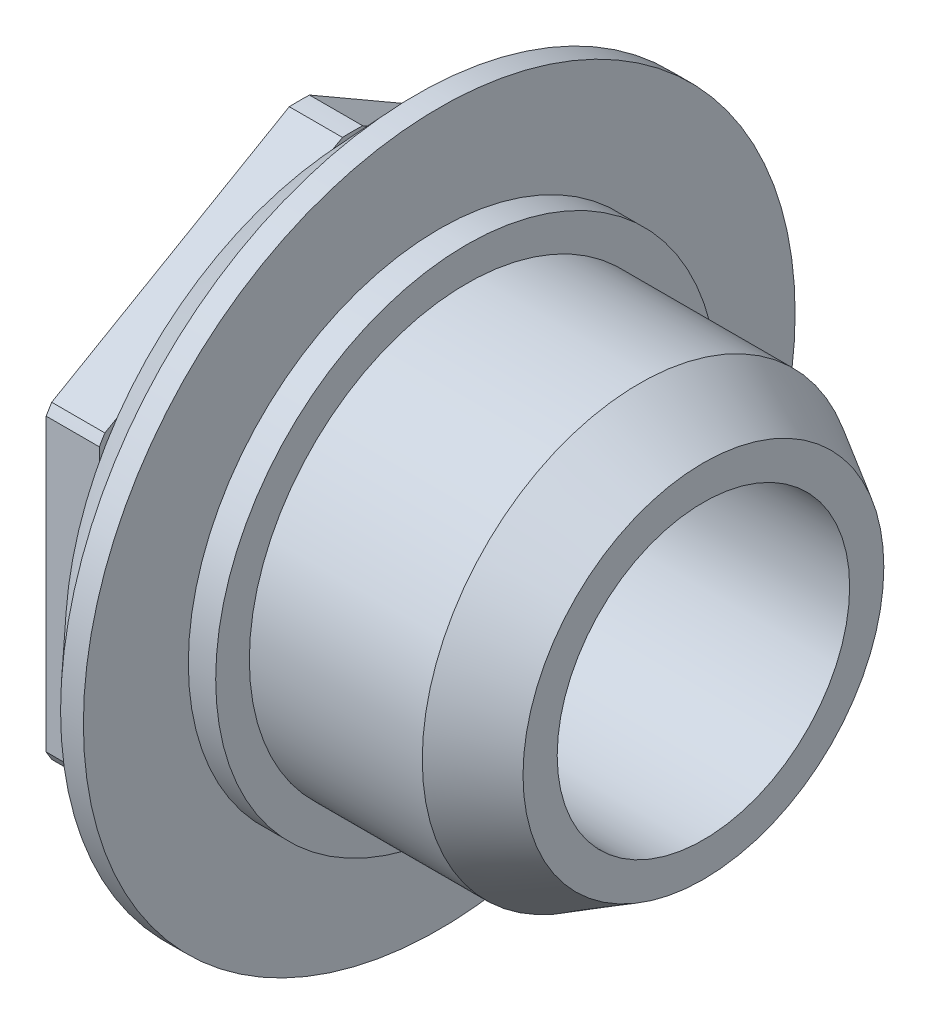
ISO-10303-21;
HEADER;
FILE_DESCRIPTION(('STEP AP214'),'2;1');
FILE_NAME('part.step','',(''),(''),'','','');
FILE_SCHEMA(('AUTOMOTIVE_DESIGN { 1 0 10303 214 1 1 1 1 }'));
ENDSEC;
DATA;
#1=APPLICATION_CONTEXT('core data for automotive mechanical design processes');
#2=APPLICATION_PROTOCOL_DEFINITION('international standard','automotive_design',2000,#1);
#3=PRODUCT_CONTEXT('',#1,'mechanical');
#4=PRODUCT('Part','Part','',(#3));
#5=PRODUCT_RELATED_PRODUCT_CATEGORY('part','',(#4));
#6=PRODUCT_DEFINITION_FORMATION('','',#4);
#7=PRODUCT_DEFINITION_CONTEXT('part definition',#1,'design');
#8=PRODUCT_DEFINITION('design','',#6,#7);
#9=PRODUCT_DEFINITION_SHAPE('','',#8);
#10=(LENGTH_UNIT() NAMED_UNIT(*) SI_UNIT(.MILLI.,.METRE.));
#11=(NAMED_UNIT(*) PLANE_ANGLE_UNIT() SI_UNIT($,.RADIAN.));
#12=(NAMED_UNIT(*) SI_UNIT($,.STERADIAN.) SOLID_ANGLE_UNIT());
#13=UNCERTAINTY_MEASURE_WITH_UNIT(LENGTH_MEASURE(1.E-05),#10,'distance_accuracy_value','');
#14=(GEOMETRIC_REPRESENTATION_CONTEXT(3) GLOBAL_UNCERTAINTY_ASSIGNED_CONTEXT((#13)) GLOBAL_UNIT_ASSIGNED_CONTEXT((#10,
#11,#12)) REPRESENTATION_CONTEXT('',''));
#15=CARTESIAN_POINT('',(0.,0.,0.));
#16=DIRECTION('',(0.,0.,1.));
#17=DIRECTION('',(1.,0.,0.));
#18=AXIS2_PLACEMENT_3D('',#15,#16,#17);
#19=CARTESIAN_POINT('',(-3.88678891678522,0.,0.));
#20=DIRECTION('',(0.818767862068712,0.394008378925014,0.417584225492671));
#21=DIRECTION('',(-0.454030191839795,0.88953011806887,0.0509190921590447));
#22=AXIS2_PLACEMENT_3D('',#19,#20,#21);
#23=SPHERICAL_SURFACE('',#22,15.8799999999365);
#24=CARTESIAN_POINT('',(-3.88678891678522,0.,0.));
#25=DIRECTION('',(-1.,0.,0.));
#26=DIRECTION('',(0.,-1.,0.));
#27=AXIS2_PLACEMENT_3D('',#24,#25,#26);
#28=SPHERICAL_SURFACE('',#27,15.8799999999365);
#29=CARTESIAN_POINT('',(-18.7653607567916,0.,0.));
#30=DIRECTION('',(-1.,0.,0.));
#31=DIRECTION('',(0.,-1.,0.));
#32=AXIS2_PLACEMENT_3D('',#29,#30,#31);
#33=CIRCLE('',#32,5.54999999997779);
#34=CARTESIAN_POINT('',(-18.7653607567916,0.,-5.54999999997779));
#35=VERTEX_POINT('',#34);
#36=CARTESIAN_POINT('',(-18.7653607567916,0.,5.54999999997779));
#37=VERTEX_POINT('',#36);
#38=EDGE_CURVE('E19',#35,#37,#33,.F.);
#39=ORIENTED_EDGE('',*,*,#38,.F.);
#40=CARTESIAN_POINT('',(-18.7653607567916,0.,0.));
#41=DIRECTION('',(-1.,0.,0.));
#42=DIRECTION('',(0.,-1.,0.));
#43=AXIS2_PLACEMENT_3D('',#40,#41,#42);
#44=CIRCLE('',#43,5.54999999997779);
#45=EDGE_CURVE('E109',#37,#35,#44,.F.);
#46=ORIENTED_EDGE('',*,*,#45,.F.);
#47=EDGE_LOOP('',(#39,#46));
#48=FACE_BOUND('',#47,.T.);
#49=CARTESIAN_POINT('',(-19.4399999999696,0.,0.));
#50=DIRECTION('',(-1.,0.,0.));
#51=DIRECTION('',(0.,0.,1.));
#52=AXIS2_PLACEMENT_3D('',#49,#50,#51);
#53=CIRCLE('',#52,3.20499999969);
#54=CARTESIAN_POINT('',(-19.4399999999696,0.,3.20499999969));
#55=VERTEX_POINT('',#54);
#56=EDGE_CURVE('E117',#55,#55,#53,.F.);
#57=ORIENTED_EDGE('',*,*,#56,.T.);
#58=EDGE_LOOP('',(#57));
#59=FACE_BOUND('',#58,.T.);
#60=ADVANCED_FACE('F16',(#48,#59),#28,.T.);
#61=CARTESIAN_POINT('',(-18.7653607567916,5.97499999997613,0.));
#62=DIRECTION('',(-1.,0.,0.));
#63=DIRECTION('',(0.,-1.,0.));
#64=AXIS2_PLACEMENT_3D('',#61,#62,#63);
#65=PLANE('',#64);
#66=DIRECTION('',(0.,-0.500000000005569,-0.866025403781224));
#67=VECTOR('',#66,1.);
#68=CARTESIAN_POINT('',(-18.7653607567916,6.39616528291186,-0.22151675635251));
#69=LINE('',#68,#67);
#70=CARTESIAN_POINT('',(-18.7653607567916,6.39616528291195,-0.221516756352401));
#71=VERTEX_POINT('',#70);
#72=CARTESIAN_POINT('',(-18.7653607567916,3.38992177975124,-5.42848324367323));
#73=VERTEX_POINT('',#72);
#74=EDGE_CURVE('E151',#71,#73,#69,.T.);
#75=ORIENTED_EDGE('',*,*,#74,.T.);
#76=CARTESIAN_POINT('',(-18.7653607567916,0.,0.));
#77=DIRECTION('',(1.,0.,0.));
#78=DIRECTION('',(0.,1.,0.));
#79=AXIS2_PLACEMENT_3D('',#76,#77,#78);
#80=CIRCLE('',#79,6.39999999997445);
#81=CARTESIAN_POINT('',(-18.7653607567916,3.18708330608401,-5.5499999999778));
#82=VERTEX_POINT('',#81);
#83=EDGE_CURVE('E154',#82,#73,#80,.T.);
#84=ORIENTED_EDGE('',*,*,#83,.F.);
#85=DIRECTION('',(0.,-1.,0.));
#86=VECTOR('',#85,1.);
#87=CARTESIAN_POINT('',(-18.7653607567916,3.1870833060839,-5.54999999997779));
#88=LINE('',#87,#86);
#89=EDGE_CURVE('E136',#82,#35,#88,.T.);
#90=ORIENTED_EDGE('',*,*,#89,.T.);
#91=ORIENTED_EDGE('',*,*,#38,.T.);
#92=DIRECTION('',(0.,1.,0.));
#93=VECTOR('',#92,1.);
#94=CARTESIAN_POINT('',(-18.7653607567916,-3.18708330608392,5.5499999999778));
#95=LINE('',#94,#93);
#96=CARTESIAN_POINT('',(-18.7653607567916,3.18708330608399,5.5499999999778));
#97=VERTEX_POINT('',#96);
#98=EDGE_CURVE('E128',#37,#97,#95,.T.);
#99=ORIENTED_EDGE('',*,*,#98,.T.);
#100=CARTESIAN_POINT('',(-18.7653607567916,0.,0.));
#101=DIRECTION('',(1.,0.,0.));
#102=DIRECTION('',(0.,1.,0.));
#103=AXIS2_PLACEMENT_3D('',#100,#101,#102);
#104=CIRCLE('',#103,6.39999999997445);
#105=CARTESIAN_POINT('',(-18.7653607567916,3.38992177975127,5.42848324367322));
#106=VERTEX_POINT('',#105);
#107=EDGE_CURVE('E129',#106,#97,#104,.T.);
#108=ORIENTED_EDGE('',*,*,#107,.F.);
#109=DIRECTION('',(0.,0.500000000005566,-0.866025403781225));
#110=VECTOR('',#109,1.);
#111=CARTESIAN_POINT('',(-18.7653607567916,3.38992177975132,5.42848324367313));
#112=LINE('',#111,#110);
#113=CARTESIAN_POINT('',(-18.7653607567916,6.39616528291194,0.221516756352378));
#114=VERTEX_POINT('',#113);
#115=EDGE_CURVE('E146',#106,#114,#112,.T.);
#116=ORIENTED_EDGE('',*,*,#115,.T.);
#117=CARTESIAN_POINT('',(-18.7653607567916,0.,0.));
#118=DIRECTION('',(1.,0.,0.));
#119=DIRECTION('',(0.,1.,0.));
#120=AXIS2_PLACEMENT_3D('',#117,#118,#119);
#121=CIRCLE('',#120,6.39999999997445);
#122=EDGE_CURVE('E214',#71,#114,#121,.T.);
#123=ORIENTED_EDGE('',*,*,#122,.F.);
#124=EDGE_LOOP('',(#75,#84,#90,#91,#99,#108,#116,#123));
#125=FACE_BOUND('',#124,.T.);
#126=ADVANCED_FACE('F132',(#125),#65,.T.);
#127=CARTESIAN_POINT('',(-18.7653607567916,5.97499999997613,0.));
#128=DIRECTION('',(-1.,0.,0.));
#129=DIRECTION('',(0.,-1.,0.));
#130=AXIS2_PLACEMENT_3D('',#127,#128,#129);
#131=PLANE('',#130);
#132=DIRECTION('',(0.,1.,0.));
#133=VECTOR('',#132,1.);
#134=CARTESIAN_POINT('',(-18.7653607567916,-3.18708330608392,5.5499999999778));
#135=LINE('',#134,#133);
#136=CARTESIAN_POINT('',(-18.7653607567916,-3.187083306084,5.54999999997781));
#137=VERTEX_POINT('',#136);
#138=EDGE_CURVE('E121',#137,#37,#135,.T.);
#139=ORIENTED_EDGE('',*,*,#138,.T.);
#140=ORIENTED_EDGE('',*,*,#45,.T.);
#141=DIRECTION('',(0.,-1.,0.));
#142=VECTOR('',#141,1.);
#143=CARTESIAN_POINT('',(-18.7653607567916,3.1870833060839,-5.54999999997779));
#144=LINE('',#143,#142);
#145=CARTESIAN_POINT('',(-18.7653607567916,-3.18708330608401,-5.5499999999778));
#146=VERTEX_POINT('',#145);
#147=EDGE_CURVE('E155',#35,#146,#144,.T.);
#148=ORIENTED_EDGE('',*,*,#147,.T.);
#149=CARTESIAN_POINT('',(-18.7653607567916,0.,0.));
#150=DIRECTION('',(1.,0.,0.));
#151=DIRECTION('',(0.,1.,0.));
#152=AXIS2_PLACEMENT_3D('',#149,#150,#151);
#153=CIRCLE('',#152,6.39999999997445);
#154=CARTESIAN_POINT('',(-18.7653607567916,-3.3899217798277,-5.42848324362549));
#155=VERTEX_POINT('',#154);
#156=EDGE_CURVE('E118',#146,#155,#153,.F.);
#157=ORIENTED_EDGE('',*,*,#156,.T.);
#158=DIRECTION('',(0.,-0.49999999999972,0.8660254037846));
#159=VECTOR('',#158,1.);
#160=CARTESIAN_POINT('',(-18.7653607567916,-3.38992177982773,-5.42848324362543));
#161=LINE('',#160,#159);
#162=CARTESIAN_POINT('',(-18.7653607567916,-6.39616528291182,-0.221516756356055));
#163=VERTEX_POINT('',#162);
#164=EDGE_CURVE('E209',#155,#163,#161,.T.);
#165=ORIENTED_EDGE('',*,*,#164,.T.);
#166=CARTESIAN_POINT('',(-18.7653607567916,0.,0.));
#167=DIRECTION('',(1.,0.,0.));
#168=DIRECTION('',(0.,1.,0.));
#169=AXIS2_PLACEMENT_3D('',#166,#167,#168);
#170=CIRCLE('',#169,6.39999999997445);
#171=CARTESIAN_POINT('',(-18.7653607567916,-6.39616528291182,0.221516756356088));
#172=VERTEX_POINT('',#171);
#173=EDGE_CURVE('E206',#172,#163,#170,.T.);
#174=ORIENTED_EDGE('',*,*,#173,.F.);
#175=DIRECTION('',(0.,0.499999999999717,0.866025403784602));
#176=VECTOR('',#175,1.);
#177=CARTESIAN_POINT('',(-18.7653607567916,-6.3961652829118,0.221516756356119));
#178=LINE('',#177,#176);
#179=CARTESIAN_POINT('',(-18.7653607567916,-3.38992177982775,5.42848324362546));
#180=VERTEX_POINT('',#179);
#181=EDGE_CURVE('E212',#172,#180,#178,.T.);
#182=ORIENTED_EDGE('',*,*,#181,.T.);
#183=CARTESIAN_POINT('',(-18.7653607567916,0.,0.));
#184=DIRECTION('',(1.,0.,0.));
#185=DIRECTION('',(0.,1.,0.));
#186=AXIS2_PLACEMENT_3D('',#183,#184,#185);
#187=CIRCLE('',#186,6.39999999997445);
#188=EDGE_CURVE('E124',#137,#180,#187,.T.);
#189=ORIENTED_EDGE('',*,*,#188,.F.);
#190=EDGE_LOOP('',(#139,#140,#148,#157,#165,#174,#182,#189));
#191=FACE_BOUND('',#190,.T.);
#192=ADVANCED_FACE('F122',(#191),#131,.T.);
#193=CARTESIAN_POINT('',(-9.91000000001118,0.,0.));
#194=DIRECTION('',(-1.,0.,0.));
#195=DIRECTION('',(0.,0.,1.));
#196=AXIS2_PLACEMENT_3D('',#193,#194,#195);
#197=CYLINDRICAL_SURFACE('',#196,3.20499999969);
#198=ORIENTED_EDGE('',*,*,#56,.F.);
#199=EDGE_LOOP('',(#198));
#200=FACE_BOUND('',#199,.T.);
#201=CARTESIAN_POINT('',(-9.91000000001118,0.,0.));
#202=DIRECTION('',(-1.,0.,0.));
#203=DIRECTION('',(0.,0.,1.));
#204=AXIS2_PLACEMENT_3D('',#201,#202,#203);
#205=CIRCLE('',#204,3.20499999969);
#206=CARTESIAN_POINT('',(-9.91000000001118,0.,3.20499999969));
#207=VERTEX_POINT('',#206);
#208=EDGE_CURVE('E203',#207,#207,#205,.T.);
#209=ORIENTED_EDGE('',*,*,#208,.F.);
#210=EDGE_LOOP('',(#209));
#211=FACE_BOUND('',#210,.T.);
#212=ADVANCED_FACE('F516',(#200,#211),#197,.F.);
#213=CARTESIAN_POINT('',(-17.4999999999808,3.1870833060839,-5.54999999997779));
#214=DIRECTION('',(0.,0.,1.));
#215=DIRECTION('',(0.,-1.,0.));
#216=AXIS2_PLACEMENT_3D('',#213,#214,#215);
#217=PLANE('',#216);
#218=DIRECTION('',(1.,0.,0.));
#219=VECTOR('',#218,1.);
#220=CARTESIAN_POINT('',(-18.182680378386,-3.187083306084,-5.5499999999778));
#221=LINE('',#220,#219);
#222=CARTESIAN_POINT('',(-17.5999999999804,-3.18708330608401,-5.5499999999778));
#223=VERTEX_POINT('',#222);
#224=EDGE_CURVE('E231',#146,#223,#221,.T.);
#225=ORIENTED_EDGE('',*,*,#224,.F.);
#226=ORIENTED_EDGE('',*,*,#147,.F.);
#227=ORIENTED_EDGE('',*,*,#89,.F.);
#228=DIRECTION('',(1.,0.,0.));
#229=VECTOR('',#228,1.);
#230=CARTESIAN_POINT('',(-18.182680378386,3.18708330608399,-5.54999999997781));
#231=LINE('',#230,#229);
#232=CARTESIAN_POINT('',(-17.5999999999804,3.187083306084,-5.5499999999778));
#233=VERTEX_POINT('',#232);
#234=EDGE_CURVE('E219',#233,#82,#231,.F.);
#235=ORIENTED_EDGE('',*,*,#234,.F.);
#236=DIRECTION('',(0.,1.,0.));
#237=VECTOR('',#236,1.);
#238=CARTESIAN_POINT('',(-17.5999999999804,0.,-5.54999999997779));
#239=LINE('',#238,#237);
#240=EDGE_CURVE('E202',#223,#233,#239,.T.);
#241=ORIENTED_EDGE('',*,*,#240,.F.);
#242=EDGE_LOOP('',(#225,#226,#227,#235,#241));
#243=FACE_BOUND('',#242,.T.);
#244=ADVANCED_FACE('F274',(#243),#217,.F.);
#245=CARTESIAN_POINT('',(-18.182680378386,0.,0.));
#246=DIRECTION('',(1.,0.,0.));
#247=DIRECTION('',(0.,1.,0.));
#248=AXIS2_PLACEMENT_3D('',#245,#246,#247);
#249=CYLINDRICAL_SURFACE('',#248,6.39999999997445);
#250=ORIENTED_EDGE('',*,*,#234,.T.);
#251=ORIENTED_EDGE('',*,*,#83,.T.);
#252=DIRECTION('',(1.,0.,0.));
#253=VECTOR('',#252,1.);
#254=CARTESIAN_POINT('',(-17.4999999999808,3.38992177975125,-5.42848324367322));
#255=LINE('',#254,#253);
#256=CARTESIAN_POINT('',(-17.5999999999804,3.38992177975126,-5.42848324367322));
#257=VERTEX_POINT('',#256);
#258=EDGE_CURVE('E153',#73,#257,#255,.T.);
#259=ORIENTED_EDGE('',*,*,#258,.T.);
#260=CARTESIAN_POINT('',(-17.5999999999804,0.,0.));
#261=DIRECTION('',(1.,0.,0.));
#262=DIRECTION('',(0.,1.,0.));
#263=AXIS2_PLACEMENT_3D('',#260,#261,#262);
#264=CIRCLE('',#263,6.39999999997445);
#265=EDGE_CURVE('E199',#233,#257,#264,.T.);
#266=ORIENTED_EDGE('',*,*,#265,.F.);
#267=EDGE_LOOP('',(#250,#251,#259,#266));
#268=FACE_BOUND('',#267,.T.);
#269=ADVANCED_FACE('F276',(#268),#249,.T.);
#270=CARTESIAN_POINT('',(-17.4999999999808,6.39616528291186,-0.22151675635251));
#271=DIRECTION('',(0.,-0.866025403781224,0.500000000005569));
#272=DIRECTION('',(0.,-0.500000000005569,-0.866025403781224));
#273=AXIS2_PLACEMENT_3D('',#270,#271,#272);
#274=PLANE('',#273);
#275=ORIENTED_EDGE('',*,*,#258,.F.);
#276=ORIENTED_EDGE('',*,*,#74,.F.);
#277=DIRECTION('',(1.,0.,0.));
#278=VECTOR('',#277,1.);
#279=CARTESIAN_POINT('',(-18.182680378386,6.39616528291195,-0.221516756352439));
#280=LINE('',#279,#278);
#281=CARTESIAN_POINT('',(-17.5999999999804,6.39616528291195,-0.221516756352439));
#282=VERTEX_POINT('',#281);
#283=EDGE_CURVE('E216',#282,#71,#280,.F.);
#284=ORIENTED_EDGE('',*,*,#283,.F.);
#285=DIRECTION('',(0.,0.500000000005571,0.866025403781222));
#286=VECTOR('',#285,1.);
#287=CARTESIAN_POINT('',(-17.5999999999804,3.38992177975127,-5.42848324367322));
#288=LINE('',#287,#286);
#289=EDGE_CURVE('E198',#257,#282,#288,.T.);
#290=ORIENTED_EDGE('',*,*,#289,.F.);
#291=EDGE_LOOP('',(#275,#276,#284,#290));
#292=FACE_BOUND('',#291,.T.);
#293=ADVANCED_FACE('F282',(#292),#274,.F.);
#294=CARTESIAN_POINT('',(-18.182680378386,0.,0.));
#295=DIRECTION('',(1.,0.,0.));
#296=DIRECTION('',(0.,1.,0.));
#297=AXIS2_PLACEMENT_3D('',#294,#295,#296);
#298=CYLINDRICAL_SURFACE('',#297,6.39999999997445);
#299=DIRECTION('',(1.,0.,0.));
#300=VECTOR('',#299,1.);
#301=CARTESIAN_POINT('',(-17.4999999999808,6.39616528291193,0.221516756352394));
#302=LINE('',#301,#300);
#303=CARTESIAN_POINT('',(-17.5999999999804,6.39616528291194,0.221516756352402));
#304=VERTEX_POINT('',#303);
#305=EDGE_CURVE('E150',#114,#304,#302,.T.);
#306=ORIENTED_EDGE('',*,*,#305,.T.);
#307=CARTESIAN_POINT('',(-17.5999999999804,0.,0.));
#308=DIRECTION('',(1.,0.,0.));
#309=DIRECTION('',(0.,1.,0.));
#310=AXIS2_PLACEMENT_3D('',#307,#308,#309);
#311=CIRCLE('',#310,6.39999999997445);
#312=EDGE_CURVE('E195',#282,#304,#311,.T.);
#313=ORIENTED_EDGE('',*,*,#312,.F.);
#314=ORIENTED_EDGE('',*,*,#283,.T.);
#315=ORIENTED_EDGE('',*,*,#122,.T.);
#316=EDGE_LOOP('',(#306,#313,#314,#315));
#317=FACE_BOUND('',#316,.T.);
#318=ADVANCED_FACE('F285',(#317),#298,.T.);
#319=CARTESIAN_POINT('',(-17.4999999999808,3.38992177975132,5.42848324367313));
#320=DIRECTION('',(0.,-0.866025403781225,-0.500000000005566));
#321=DIRECTION('',(0.,0.500000000005566,-0.866025403781225));
#322=AXIS2_PLACEMENT_3D('',#319,#320,#321);
#323=PLANE('',#322);
#324=DIRECTION('',(1.,0.,0.));
#325=VECTOR('',#324,1.);
#326=CARTESIAN_POINT('',(-18.182680378386,3.38992177975127,5.42848324367322));
#327=LINE('',#326,#325);
#328=CARTESIAN_POINT('',(-17.5999999999804,3.38992177975127,5.42848324367322));
#329=VERTEX_POINT('',#328);
#330=EDGE_CURVE('E149',#329,#106,#327,.F.);
#331=ORIENTED_EDGE('',*,*,#330,.F.);
#332=DIRECTION('',(0.,-0.500000000005569,0.866025403781223));
#333=VECTOR('',#332,1.);
#334=CARTESIAN_POINT('',(-17.5999999999804,6.39616528291193,0.221516756352442));
#335=LINE('',#334,#333);
#336=EDGE_CURVE('E194',#304,#329,#335,.T.);
#337=ORIENTED_EDGE('',*,*,#336,.F.);
#338=ORIENTED_EDGE('',*,*,#305,.F.);
#339=ORIENTED_EDGE('',*,*,#115,.F.);
#340=EDGE_LOOP('',(#331,#337,#338,#339));
#341=FACE_BOUND('',#340,.T.);
#342=ADVANCED_FACE('F288',(#341),#323,.F.);
#343=CARTESIAN_POINT('',(-18.182680378386,0.,0.));
#344=DIRECTION('',(1.,0.,0.));
#345=DIRECTION('',(0.,1.,0.));
#346=AXIS2_PLACEMENT_3D('',#343,#344,#345);
#347=CYLINDRICAL_SURFACE('',#346,6.39999999997445);
#348=DIRECTION('',(1.,0.,0.));
#349=VECTOR('',#348,1.);
#350=CARTESIAN_POINT('',(-17.4999999999808,3.18708330608397,5.5499999999778));
#351=LINE('',#350,#349);
#352=CARTESIAN_POINT('',(-17.5999999999804,3.18708330608399,5.5499999999778));
#353=VERTEX_POINT('',#352);
#354=EDGE_CURVE('E140',#97,#353,#351,.T.);
#355=ORIENTED_EDGE('',*,*,#354,.T.);
#356=CARTESIAN_POINT('',(-17.5999999999804,0.,0.));
#357=DIRECTION('',(1.,0.,0.));
#358=DIRECTION('',(0.,1.,0.));
#359=AXIS2_PLACEMENT_3D('',#356,#357,#358);
#360=CIRCLE('',#359,6.39999999997445);
#361=EDGE_CURVE('E191',#329,#353,#360,.T.);
#362=ORIENTED_EDGE('',*,*,#361,.F.);
#363=ORIENTED_EDGE('',*,*,#330,.T.);
#364=ORIENTED_EDGE('',*,*,#107,.T.);
#365=EDGE_LOOP('',(#355,#362,#363,#364));
#366=FACE_BOUND('',#365,.T.);
#367=ADVANCED_FACE('F290',(#366),#347,.T.);
#368=CARTESIAN_POINT('',(-17.4999999999808,-3.18708330608392,5.5499999999778));
#369=DIRECTION('',(0.,0.,-1.));
#370=DIRECTION('',(0.,1.,0.));
#371=AXIS2_PLACEMENT_3D('',#368,#369,#370);
#372=PLANE('',#371);
#373=ORIENTED_EDGE('',*,*,#354,.F.);
#374=ORIENTED_EDGE('',*,*,#98,.F.);
#375=ORIENTED_EDGE('',*,*,#138,.F.);
#376=DIRECTION('',(1.,0.,0.));
#377=VECTOR('',#376,1.);
#378=CARTESIAN_POINT('',(-18.182680378386,-3.18708330608399,5.54999999997781));
#379=LINE('',#378,#377);
#380=CARTESIAN_POINT('',(-17.5999999999804,-3.187083306084,5.54999999997781));
#381=VERTEX_POINT('',#380);
#382=EDGE_CURVE('E142',#381,#137,#379,.F.);
#383=ORIENTED_EDGE('',*,*,#382,.F.);
#384=DIRECTION('',(0.,1.,0.));
#385=VECTOR('',#384,1.);
#386=CARTESIAN_POINT('',(-17.5999999999804,0.,5.5499999999778));
#387=LINE('',#386,#385);
#388=EDGE_CURVE('E190',#353,#381,#387,.F.);
#389=ORIENTED_EDGE('',*,*,#388,.F.);
#390=EDGE_LOOP('',(#373,#374,#375,#383,#389));
#391=FACE_BOUND('',#390,.T.);
#392=ADVANCED_FACE('F138',(#391),#372,.F.);
#393=CARTESIAN_POINT('',(-18.182680378386,0.,0.));
#394=DIRECTION('',(1.,0.,0.));
#395=DIRECTION('',(0.,1.,0.));
#396=AXIS2_PLACEMENT_3D('',#393,#394,#395);
#397=CYLINDRICAL_SURFACE('',#396,6.39999999997445);
#398=ORIENTED_EDGE('',*,*,#382,.T.);
#399=ORIENTED_EDGE('',*,*,#188,.T.);
#400=DIRECTION('',(1.,0.,0.));
#401=VECTOR('',#400,1.);
#402=CARTESIAN_POINT('',(-17.4999999999808,-3.38992177982776,5.42848324362545));
#403=LINE('',#402,#401);
#404=CARTESIAN_POINT('',(-17.5999999999804,-3.38992177982775,5.42848324362546));
#405=VERTEX_POINT('',#404);
#406=EDGE_CURVE('E239',#180,#405,#403,.T.);
#407=ORIENTED_EDGE('',*,*,#406,.T.);
#408=CARTESIAN_POINT('',(-17.5999999999804,0.,0.));
#409=DIRECTION('',(1.,0.,0.));
#410=DIRECTION('',(0.,1.,0.));
#411=AXIS2_PLACEMENT_3D('',#408,#409,#410);
#412=CIRCLE('',#411,6.39999999997445);
#413=EDGE_CURVE('E187',#381,#405,#412,.T.);
#414=ORIENTED_EDGE('',*,*,#413,.F.);
#415=EDGE_LOOP('',(#398,#399,#407,#414));
#416=FACE_BOUND('',#415,.T.);
#417=ADVANCED_FACE('F253',(#416),#397,.T.);
#418=CARTESIAN_POINT('',(-17.4999999999808,-6.3961652829118,0.221516756356119));
#419=DIRECTION('',(0.,0.866025403784602,-0.499999999999717));
#420=DIRECTION('',(0.,0.499999999999717,0.866025403784602));
#421=AXIS2_PLACEMENT_3D('',#418,#419,#420);
#422=PLANE('',#421);
#423=ORIENTED_EDGE('',*,*,#406,.F.);
#424=ORIENTED_EDGE('',*,*,#181,.F.);
#425=DIRECTION('',(1.,0.,0.));
#426=VECTOR('',#425,1.);
#427=CARTESIAN_POINT('',(-18.182680378386,-6.39616528291182,0.2215167563561));
#428=LINE('',#427,#426);
#429=CARTESIAN_POINT('',(-17.5999999999804,-6.39616528291182,0.2215167563561));
#430=VERTEX_POINT('',#429);
#431=EDGE_CURVE('E210',#430,#172,#428,.F.);
#432=ORIENTED_EDGE('',*,*,#431,.F.);
#433=DIRECTION('',(0.,-0.499999999999719,-0.866025403784601));
#434=VECTOR('',#433,1.);
#435=CARTESIAN_POINT('',(-17.5999999999804,-3.38992177982775,5.42848324362545));
#436=LINE('',#435,#434);
#437=EDGE_CURVE('E186',#405,#430,#436,.T.);
#438=ORIENTED_EDGE('',*,*,#437,.F.);
#439=EDGE_LOOP('',(#423,#424,#432,#438));
#440=FACE_BOUND('',#439,.T.);
#441=ADVANCED_FACE('F256',(#440),#422,.F.);
#442=CARTESIAN_POINT('',(-18.182680378386,0.,0.));
#443=DIRECTION('',(1.,0.,0.));
#444=DIRECTION('',(0.,1.,0.));
#445=AXIS2_PLACEMENT_3D('',#442,#443,#444);
#446=CYLINDRICAL_SURFACE('',#445,6.39999999997445);
#447=DIRECTION('',(1.,0.,0.));
#448=VECTOR('',#447,1.);
#449=CARTESIAN_POINT('',(-17.4999999999808,-6.39616528291181,-0.221516756356064));
#450=LINE('',#449,#448);
#451=CARTESIAN_POINT('',(-17.5999999999804,-6.39616528291182,-0.221516756356062));
#452=VERTEX_POINT('',#451);
#453=EDGE_CURVE('E227',#163,#452,#450,.T.);
#454=ORIENTED_EDGE('',*,*,#453,.T.);
#455=CARTESIAN_POINT('',(-17.5999999999804,0.,0.));
#456=DIRECTION('',(1.,0.,0.));
#457=DIRECTION('',(0.,1.,0.));
#458=AXIS2_PLACEMENT_3D('',#455,#456,#457);
#459=CIRCLE('',#458,6.39999999997445);
#460=EDGE_CURVE('E183',#430,#452,#459,.T.);
#461=ORIENTED_EDGE('',*,*,#460,.F.);
#462=ORIENTED_EDGE('',*,*,#431,.T.);
#463=ORIENTED_EDGE('',*,*,#173,.T.);
#464=EDGE_LOOP('',(#454,#461,#462,#463));
#465=FACE_BOUND('',#464,.T.);
#466=ADVANCED_FACE('F350',(#465),#446,.T.);
#467=CARTESIAN_POINT('',(-17.4999999999808,-3.38992177982773,-5.42848324362543));
#468=DIRECTION('',(0.,0.8660254037846,0.49999999999972));
#469=DIRECTION('',(0.,-0.49999999999972,0.8660254037846));
#470=AXIS2_PLACEMENT_3D('',#467,#468,#469);
#471=PLANE('',#470);
#472=ORIENTED_EDGE('',*,*,#453,.F.);
#473=ORIENTED_EDGE('',*,*,#164,.F.);
#474=DIRECTION('',(1.,0.,0.));
#475=VECTOR('',#474,1.);
#476=CARTESIAN_POINT('',(-18.182680378386,-3.38992177982772,-5.42848324362548));
#477=LINE('',#476,#475);
#478=CARTESIAN_POINT('',(-17.5999999999804,-3.38992177982772,-5.42848324362548));
#479=VERTEX_POINT('',#478);
#480=EDGE_CURVE('E34',#479,#155,#477,.F.);
#481=ORIENTED_EDGE('',*,*,#480,.F.);
#482=DIRECTION('',(0.,0.499999999999718,-0.866025403784602));
#483=VECTOR('',#482,1.);
#484=CARTESIAN_POINT('',(-17.5999999999804,-6.39616528291181,-0.221516756356072));
#485=LINE('',#484,#483);
#486=EDGE_CURVE('E182',#452,#479,#485,.T.);
#487=ORIENTED_EDGE('',*,*,#486,.F.);
#488=EDGE_LOOP('',(#472,#473,#481,#487));
#489=FACE_BOUND('',#488,.T.);
#490=ADVANCED_FACE('F226',(#489),#471,.F.);
#491=CARTESIAN_POINT('',(-18.182680378386,0.,0.));
#492=DIRECTION('',(1.,0.,0.));
#493=DIRECTION('',(0.,1.,0.));
#494=AXIS2_PLACEMENT_3D('',#491,#492,#493);
#495=CYLINDRICAL_SURFACE('',#494,6.39999999997445);
#496=ORIENTED_EDGE('',*,*,#480,.T.);
#497=ORIENTED_EDGE('',*,*,#156,.F.);
#498=ORIENTED_EDGE('',*,*,#224,.T.);
#499=CARTESIAN_POINT('',(-17.5999999999804,0.,0.));
#500=DIRECTION('',(1.,0.,0.));
#501=DIRECTION('',(0.,1.,0.));
#502=AXIS2_PLACEMENT_3D('',#499,#500,#501);
#503=CIRCLE('',#502,6.39999999997445);
#504=EDGE_CURVE('E179',#479,#223,#503,.T.);
#505=ORIENTED_EDGE('',*,*,#504,.F.);
#506=EDGE_LOOP('',(#496,#497,#498,#505));
#507=FACE_BOUND('',#506,.T.);
#508=ADVANCED_FACE('F229',(#507),#495,.T.);
#509=CARTESIAN_POINT('',(-9.91000000001118,0.,1.97710481156708));
#510=DIRECTION('',(1.,0.,0.));
#511=DIRECTION('',(0.,0.,-1.));
#512=AXIS2_PLACEMENT_3D('',#509,#510,#511);
#513=PLANE('',#512);
#514=CARTESIAN_POINT('',(-9.90999999993392,0.,0.));
#515=DIRECTION('',(-1.,0.,0.));
#516=DIRECTION('',(0.,0.,1.));
#517=AXIS2_PLACEMENT_3D('',#514,#515,#516);
#518=CIRCLE('',#517,3.95420962314574);
#519=CARTESIAN_POINT('',(-9.90999999993392,0.,3.95420962314574));
#520=VERTEX_POINT('',#519);
#521=EDGE_CURVE('E176',#520,#520,#518,.T.);
#522=ORIENTED_EDGE('',*,*,#521,.F.);
#523=EDGE_LOOP('',(#522));
#524=FACE_BOUND('',#523,.T.);
#525=ORIENTED_EDGE('',*,*,#208,.T.);
#526=EDGE_LOOP('',(#525));
#527=FACE_BOUND('',#526,.T.);
#528=ADVANCED_FACE('F342',(#524,#527),#513,.T.);
#529=CARTESIAN_POINT('',(-17.5999999999804,0.,5.47499999997809));
#530=DIRECTION('',(1.,0.,0.));
#531=DIRECTION('',(0.,0.,-1.));
#532=AXIS2_PLACEMENT_3D('',#529,#530,#531);
#533=PLANE('',#532);
#534=ORIENTED_EDGE('',*,*,#486,.T.);
#535=ORIENTED_EDGE('',*,*,#504,.T.);
#536=ORIENTED_EDGE('',*,*,#240,.T.);
#537=ORIENTED_EDGE('',*,*,#265,.T.);
#538=ORIENTED_EDGE('',*,*,#289,.T.);
#539=ORIENTED_EDGE('',*,*,#312,.T.);
#540=ORIENTED_EDGE('',*,*,#336,.T.);
#541=ORIENTED_EDGE('',*,*,#361,.T.);
#542=ORIENTED_EDGE('',*,*,#388,.T.);
#543=ORIENTED_EDGE('',*,*,#413,.T.);
#544=ORIENTED_EDGE('',*,*,#437,.T.);
#545=ORIENTED_EDGE('',*,*,#460,.T.);
#546=EDGE_LOOP('',(#534,#535,#536,#537,#538,#539,#540,#541,#542,#543,#544,#545));
#547=FACE_BOUND('',#546,.T.);
#548=CARTESIAN_POINT('',(-17.5999999999804,0.,0.));
#549=DIRECTION('',(1.,0.,0.));
#550=DIRECTION('',(0.,0.,-1.));
#551=AXIS2_PLACEMENT_3D('',#548,#549,#550);
#552=CIRCLE('',#551,5.3999999999784);
#553=CARTESIAN_POINT('',(-17.5999999999804,0.,-5.3999999999784));
#554=VERTEX_POINT('',#553);
#555=EDGE_CURVE('E173',#554,#554,#552,.T.);
#556=ORIENTED_EDGE('',*,*,#555,.F.);
#557=EDGE_LOOP('',(#556));
#558=FACE_BOUND('',#557,.T.);
#559=ADVANCED_FACE('F262',(#547,#558),#533,.T.);
#560=CARTESIAN_POINT('',(-11.3099999999804,0.,0.));
#561=DIRECTION('',(-1.,0.,0.));
#562=DIRECTION('',(0.,0.,1.));
#563=AXIS2_PLACEMENT_3D('',#560,#561,#562);
#564=CONICAL_SURFACE('',#563,4.7624999999698,0.523598775561738);
#565=CARTESIAN_POINT('',(-11.3100000000056,0.,0.));
#566=DIRECTION('',(1.,0.,0.));
#567=DIRECTION('',(0.,0.,-1.));
#568=AXIS2_PLACEMENT_3D('',#565,#566,#567);
#569=CIRCLE('',#568,4.76249999998096);
#570=CARTESIAN_POINT('',(-11.3100000000056,0.,-4.76249999998096));
#571=VERTEX_POINT('',#570);
#572=EDGE_CURVE('E172',#571,#571,#569,.F.);
#573=ORIENTED_EDGE('',*,*,#572,.F.);
#574=EDGE_LOOP('',(#573));
#575=FACE_BOUND('',#574,.T.);
#576=ORIENTED_EDGE('',*,*,#521,.T.);
#577=EDGE_LOOP('',(#576));
#578=FACE_BOUND('',#577,.T.);
#579=ADVANCED_FACE('F335',(#575,#578),#564,.T.);
#580=CARTESIAN_POINT('',(-17.5499999999806,0.,0.));
#581=DIRECTION('',(1.,0.,0.));
#582=DIRECTION('',(0.,0.,-1.));
#583=AXIS2_PLACEMENT_3D('',#580,#581,#582);
#584=CYLINDRICAL_SURFACE('',#583,5.3999999999784);
#585=ORIENTED_EDGE('',*,*,#555,.T.);
#586=EDGE_LOOP('',(#585));
#587=FACE_BOUND('',#586,.T.);
#588=CARTESIAN_POINT('',(-17.4999999999808,0.,0.));
#589=DIRECTION('',(1.,0.,0.));
#590=DIRECTION('',(0.,0.,-1.));
#591=AXIS2_PLACEMENT_3D('',#588,#589,#590);
#592=CIRCLE('',#591,5.3999999999784);
#593=CARTESIAN_POINT('',(-17.4999999999808,0.,-5.3999999999784));
#594=VERTEX_POINT('',#593);
#595=EDGE_CURVE('E169',#594,#594,#592,.T.);
#596=ORIENTED_EDGE('',*,*,#595,.F.);
#597=EDGE_LOOP('',(#596));
#598=FACE_BOUND('',#597,.T.);
#599=ADVANCED_FACE('F331',(#587,#598),#584,.T.);
#600=CARTESIAN_POINT('',(-13.204999999998,0.,0.));
#601=DIRECTION('',(1.,0.,0.));
#602=DIRECTION('',(0.,0.,-1.));
#603=AXIS2_PLACEMENT_3D('',#600,#601,#602);
#604=CYLINDRICAL_SURFACE('',#603,4.76249999998096);
#605=ORIENTED_EDGE('',*,*,#572,.T.);
#606=EDGE_LOOP('',(#605));
#607=FACE_BOUND('',#606,.T.);
#608=CARTESIAN_POINT('',(-15.0999999999904,0.,0.));
#609=DIRECTION('',(1.,0.,0.));
#610=DIRECTION('',(0.,0.,-1.));
#611=AXIS2_PLACEMENT_3D('',#608,#609,#610);
#612=CIRCLE('',#611,4.76249999998096);
#613=CARTESIAN_POINT('',(-15.0999999999904,0.,-4.76249999998096));
#614=VERTEX_POINT('',#613);
#615=EDGE_CURVE('E166',#614,#614,#612,.F.);
#616=ORIENTED_EDGE('',*,*,#615,.F.);
#617=EDGE_LOOP('',(#616));
#618=FACE_BOUND('',#617,.T.);
#619=ADVANCED_FACE('F327',(#607,#618),#604,.T.);
#620=CARTESIAN_POINT('',(-17.4999999999808,0.,5.89999999997641));
#621=DIRECTION('',(-1.,0.,0.));
#622=DIRECTION('',(0.,0.,1.));
#623=AXIS2_PLACEMENT_3D('',#620,#621,#622);
#624=PLANE('',#623);
#625=ORIENTED_EDGE('',*,*,#595,.T.);
#626=EDGE_LOOP('',(#625));
#627=FACE_BOUND('',#626,.T.);
#628=CARTESIAN_POINT('',(-17.4999999999808,0.,0.));
#629=DIRECTION('',(1.,0.,0.));
#630=DIRECTION('',(0.,0.,-1.));
#631=AXIS2_PLACEMENT_3D('',#628,#629,#630);
#632=CIRCLE('',#631,6.39999999997439);
#633=CARTESIAN_POINT('',(-17.4999999999808,0.,-6.39999999997439));
#634=VERTEX_POINT('',#633);
#635=EDGE_CURVE('E163',#634,#634,#632,.T.);
#636=ORIENTED_EDGE('',*,*,#635,.F.);
#637=EDGE_LOOP('',(#636));
#638=FACE_BOUND('',#637,.T.);
#639=ADVANCED_FACE('F323',(#627,#638),#624,.T.);
#640=CARTESIAN_POINT('',(-15.0999999999904,0.,5.13124999997948));
#641=DIRECTION('',(1.,0.,0.));
#642=DIRECTION('',(0.,0.,-1.));
#643=AXIS2_PLACEMENT_3D('',#640,#641,#642);
#644=PLANE('',#643);
#645=CARTESIAN_POINT('',(-15.0999999999904,0.,0.));
#646=DIRECTION('',(1.,0.,0.));
#647=DIRECTION('',(0.,0.,-1.));
#648=AXIS2_PLACEMENT_3D('',#645,#646,#647);
#649=CIRCLE('',#648,5.49999999997799);
#650=CARTESIAN_POINT('',(-15.0999999999904,0.,-5.49999999997799));
#651=VERTEX_POINT('',#650);
#652=EDGE_CURVE('E160',#651,#651,#649,.F.);
#653=ORIENTED_EDGE('',*,*,#652,.F.);
#654=EDGE_LOOP('',(#653));
#655=FACE_BOUND('',#654,.T.);
#656=ORIENTED_EDGE('',*,*,#615,.T.);
#657=EDGE_LOOP('',(#656));
#658=FACE_BOUND('',#657,.T.);
#659=ADVANCED_FACE('F319',(#655,#658),#644,.T.);
#660=CARTESIAN_POINT('',(-16.199999999986,0.,0.));
#661=DIRECTION('',(1.,0.,0.));
#662=DIRECTION('',(0.,0.,-1.));
#663=AXIS2_PLACEMENT_3D('',#660,#661,#662);
#664=CONICAL_SURFACE('',#663,7.79999999996881,0.822418279271377);
#665=ORIENTED_EDGE('',*,*,#635,.T.);
#666=EDGE_LOOP('',(#665));
#667=FACE_BOUND('',#666,.T.);
#668=CARTESIAN_POINT('',(-16.199999999986,0.,0.));
#669=DIRECTION('',(1.,0.,0.));
#670=DIRECTION('',(0.,0.,-1.));
#671=AXIS2_PLACEMENT_3D('',#668,#669,#670);
#672=CIRCLE('',#671,7.79999999996881);
#673=CARTESIAN_POINT('',(-16.199999999986,0.,-7.79999999996881));
#674=VERTEX_POINT('',#673);
#675=EDGE_CURVE('E159',#674,#674,#672,.T.);
#676=ORIENTED_EDGE('',*,*,#675,.F.);
#677=EDGE_LOOP('',(#676));
#678=FACE_BOUND('',#677,.T.);
#679=ADVANCED_FACE('F315',(#667,#678),#664,.T.);
#680=CARTESIAN_POINT('',(-15.3999999999892,0.,0.));
#681=DIRECTION('',(1.,0.,0.));
#682=DIRECTION('',(0.,0.,-1.));
#683=AXIS2_PLACEMENT_3D('',#680,#681,#682);
#684=CYLINDRICAL_SURFACE('',#683,5.49999999997799);
#685=ORIENTED_EDGE('',*,*,#652,.T.);
#686=EDGE_LOOP('',(#685));
#687=FACE_BOUND('',#686,.T.);
#688=CARTESIAN_POINT('',(-15.699999999988,0.,0.));
#689=DIRECTION('',(1.,0.,0.));
#690=DIRECTION('',(0.,0.,-1.));
#691=AXIS2_PLACEMENT_3D('',#688,#689,#690);
#692=CIRCLE('',#691,5.49999999997799);
#693=CARTESIAN_POINT('',(-15.699999999988,0.,-5.49999999997799));
#694=VERTEX_POINT('',#693);
#695=EDGE_CURVE('E25',#694,#694,#692,.F.);
#696=ORIENTED_EDGE('',*,*,#695,.F.);
#697=EDGE_LOOP('',(#696));
#698=FACE_BOUND('',#697,.T.);
#699=ADVANCED_FACE('F308',(#687,#698),#684,.T.);
#700=CARTESIAN_POINT('',(-15.949999999987,0.,0.));
#701=DIRECTION('',(1.,0.,0.));
#702=DIRECTION('',(0.,0.,-1.));
#703=AXIS2_PLACEMENT_3D('',#700,#701,#702);
#704=CYLINDRICAL_SURFACE('',#703,7.79999999996881);
#705=ORIENTED_EDGE('',*,*,#675,.T.);
#706=EDGE_LOOP('',(#705));
#707=FACE_BOUND('',#706,.T.);
#708=CARTESIAN_POINT('',(-15.699999999988,0.,0.));
#709=DIRECTION('',(1.,0.,0.));
#710=DIRECTION('',(0.,0.,-1.));
#711=AXIS2_PLACEMENT_3D('',#708,#709,#710);
#712=CIRCLE('',#711,7.79999999996881);
#713=CARTESIAN_POINT('',(-15.699999999988,0.,-7.79999999996881));
#714=VERTEX_POINT('',#713);
#715=EDGE_CURVE('E10',#714,#714,#712,.T.);
#716=ORIENTED_EDGE('',*,*,#715,.F.);
#717=EDGE_LOOP('',(#716));
#718=FACE_BOUND('',#717,.T.);
#719=ADVANCED_FACE('F302',(#707,#718),#704,.T.);
#720=CARTESIAN_POINT('',(-15.699999999988,0.,6.6499999999734));
#721=DIRECTION('',(1.,0.,0.));
#722=DIRECTION('',(0.,0.,-1.));
#723=AXIS2_PLACEMENT_3D('',#720,#721,#722);
#724=PLANE('',#723);
#725=ORIENTED_EDGE('',*,*,#715,.T.);
#726=EDGE_LOOP('',(#725));
#727=FACE_BOUND('',#726,.T.);
#728=ORIENTED_EDGE('',*,*,#695,.T.);
#729=EDGE_LOOP('',(#728));
#730=FACE_BOUND('',#729,.T.);
#731=ADVANCED_FACE('F300',(#727,#730),#724,.T.);
#732=CLOSED_SHELL('',(#60,#126,#192,#212,#244,#269,#293,#318,#342,#367,#392,#417,#441,#466,#490,
#508,#528,#559,#579,#599,#619,#639,#659,#679,#699,#719,#731));
#733=MANIFOLD_SOLID_BREP('B1',#732);
#734=ADVANCED_BREP_SHAPE_REPRESENTATION('',(#18,#733),#14);
#735=SHAPE_DEFINITION_REPRESENTATION(#9,#734);
ENDSEC;
END-ISO-10303-21;
